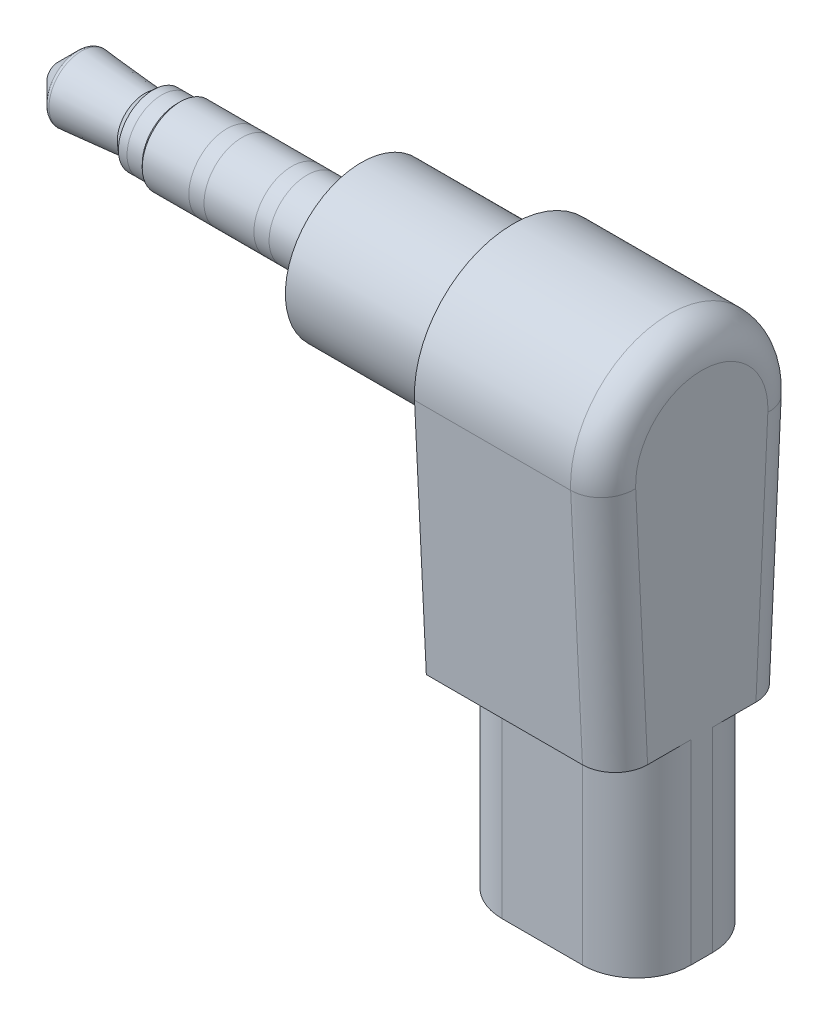
ISO-10303-21;
HEADER;
FILE_DESCRIPTION(('STEP AP214'),'2;1');
FILE_NAME('part.step','',(''),(''),'','','');
FILE_SCHEMA(('AUTOMOTIVE_DESIGN { 1 0 10303 214 1 1 1 1 }'));
ENDSEC;
DATA;
#1=APPLICATION_CONTEXT('core data for automotive mechanical design processes');
#2=APPLICATION_PROTOCOL_DEFINITION('international standard','automotive_design',2000,#1);
#3=PRODUCT_CONTEXT('',#1,'mechanical');
#4=PRODUCT('Part','Part','',(#3));
#5=PRODUCT_RELATED_PRODUCT_CATEGORY('part','',(#4));
#6=PRODUCT_DEFINITION_FORMATION('','',#4);
#7=PRODUCT_DEFINITION_CONTEXT('part definition',#1,'design');
#8=PRODUCT_DEFINITION('design','',#6,#7);
#9=PRODUCT_DEFINITION_SHAPE('','',#8);
#10=(LENGTH_UNIT() NAMED_UNIT(*) SI_UNIT(.MILLI.,.METRE.));
#11=(NAMED_UNIT(*) PLANE_ANGLE_UNIT() SI_UNIT($,.RADIAN.));
#12=(NAMED_UNIT(*) SI_UNIT($,.STERADIAN.) SOLID_ANGLE_UNIT());
#13=UNCERTAINTY_MEASURE_WITH_UNIT(LENGTH_MEASURE(1.E-05),#10,'distance_accuracy_value','');
#14=(GEOMETRIC_REPRESENTATION_CONTEXT(3) GLOBAL_UNCERTAINTY_ASSIGNED_CONTEXT((#13)) GLOBAL_UNIT_ASSIGNED_CONTEXT((#10,
#11,#12)) REPRESENTATION_CONTEXT('',''));
#15=CARTESIAN_POINT('',(0.,0.,0.));
#16=DIRECTION('',(0.,0.,1.));
#17=DIRECTION('',(1.,0.,0.));
#18=AXIS2_PLACEMENT_3D('',#15,#16,#17);
#19=CARTESIAN_POINT('',(1.07583027953361,0.,0.));
#20=DIRECTION('',(1.,0.,0.));
#21=DIRECTION('',(0.,0.,-1.));
#22=AXIS2_PLACEMENT_3D('',#19,#20,#21);
#23=TOROIDAL_SURFACE('',#22,1.29298756705899,0.2);
#24=CARTESIAN_POINT('',(0.934408923296304,0.,0.));
#25=DIRECTION('',(1.,0.,0.));
#26=DIRECTION('',(0.,-1.,0.));
#27=AXIS2_PLACEMENT_3D('',#24,#25,#26);
#28=CIRCLE('',#27,1.4344089232963);
#29=CARTESIAN_POINT('',(0.934408923296304,1.4344089232963,0.));
#30=VERTEX_POINT('',#29);
#31=EDGE_CURVE('E275',#30,#30,#28,.T.);
#32=ORIENTED_EDGE('',*,*,#31,.T.);
#33=EDGE_LOOP('',(#32));
#34=FACE_BOUND('',#33,.T.);
#35=CARTESIAN_POINT('',(1.09243937550436,0.,0.));
#36=DIRECTION('',(-1.,0.,0.));
#37=DIRECTION('',(0.,-1.,0.));
#38=AXIS2_PLACEMENT_3D('',#35,#36,#37);
#39=CIRCLE('',#38,1.49229671870797);
#40=CARTESIAN_POINT('',(1.09243937550436,1.49229671870797,0.));
#41=VERTEX_POINT('',#40);
#42=EDGE_CURVE('E264',#41,#41,#39,.T.);
#43=ORIENTED_EDGE('',*,*,#42,.T.);
#44=EDGE_LOOP('',(#43));
#45=FACE_BOUND('',#44,.T.);
#46=ADVANCED_FACE('F55',(#34,#45),#23,.T.);
#47=CARTESIAN_POINT('',(0.5,0.,0.));
#48=DIRECTION('',(1.,0.,0.));
#49=DIRECTION('',(0.,1.,0.));
#50=AXIS2_PLACEMENT_3D('',#47,#48,#49);
#51=CONICAL_SURFACE('',#50,1.,0.7853981634);
#52=CARTESIAN_POINT('',(0.,0.,0.));
#53=DIRECTION('',(1.,0.,0.));
#54=DIRECTION('',(0.,0.,-1.));
#55=AXIS2_PLACEMENT_3D('',#52,#53,#54);
#56=CIRCLE('',#55,0.5);
#57=CARTESIAN_POINT('',(0.,0.5,0.));
#58=VERTEX_POINT('',#57);
#59=EDGE_CURVE('E261',#58,#58,#56,.T.);
#60=ORIENTED_EDGE('',*,*,#59,.T.);
#61=EDGE_LOOP('',(#60));
#62=FACE_BOUND('',#61,.T.);
#63=ORIENTED_EDGE('',*,*,#31,.F.);
#64=EDGE_LOOP('',(#63));
#65=FACE_BOUND('',#64,.T.);
#66=ADVANCED_FACE('F407',(#62,#65),#51,.T.);
#67=CARTESIAN_POINT('',(2.5,0.,0.));
#68=DIRECTION('',(-1.,0.,0.));
#69=DIRECTION('',(0.,1.,0.));
#70=AXIS2_PLACEMENT_3D('',#67,#68,#69);
#71=CONICAL_SURFACE('',#70,1.375,0.083141231888712);
#72=CARTESIAN_POINT('',(4.,0.,0.));
#73=DIRECTION('',(1.,0.,0.));
#74=DIRECTION('',(0.,0.,-1.));
#75=AXIS2_PLACEMENT_3D('',#72,#73,#74);
#76=CIRCLE('',#75,1.25);
#77=CARTESIAN_POINT('',(4.,1.25,0.));
#78=VERTEX_POINT('',#77);
#79=EDGE_CURVE('E260',#78,#78,#76,.T.);
#80=ORIENTED_EDGE('',*,*,#79,.F.);
#81=EDGE_LOOP('',(#80));
#82=FACE_BOUND('',#81,.T.);
#83=ORIENTED_EDGE('',*,*,#42,.F.);
#84=EDGE_LOOP('',(#83));
#85=FACE_BOUND('',#84,.T.);
#86=ADVANCED_FACE('F413',(#82,#85),#71,.T.);
#87=CARTESIAN_POINT('',(5.15,0.,0.));
#88=DIRECTION('',(1.,0.,0.));
#89=DIRECTION('',(0.,1.,0.));
#90=AXIS2_PLACEMENT_3D('',#87,#88,#89);
#91=CYLINDRICAL_SURFACE('',#90,1.6);
#92=CARTESIAN_POINT('',(4.4,0.,0.));
#93=DIRECTION('',(1.,0.,0.));
#94=DIRECTION('',(0.,0.,-1.));
#95=AXIS2_PLACEMENT_3D('',#92,#93,#94);
#96=CIRCLE('',#95,1.6);
#97=CARTESIAN_POINT('',(4.4,1.6,0.));
#98=VERTEX_POINT('',#97);
#99=EDGE_CURVE('E265',#98,#98,#96,.T.);
#100=ORIENTED_EDGE('',*,*,#99,.T.);
#101=EDGE_LOOP('',(#100));
#102=FACE_BOUND('',#101,.T.);
#103=CARTESIAN_POINT('',(4.8,0.,0.));
#104=DIRECTION('',(1.,0.,0.));
#105=DIRECTION('',(0.,1.,0.));
#106=AXIS2_PLACEMENT_3D('',#103,#104,#105);
#107=CIRCLE('',#106,1.6);
#108=CARTESIAN_POINT('',(4.8,-1.6,0.));
#109=VERTEX_POINT('',#108);
#110=EDGE_CURVE('E274',#109,#109,#107,.T.);
#111=ORIENTED_EDGE('',*,*,#110,.F.);
#112=EDGE_LOOP('',(#111));
#113=FACE_BOUND('',#112,.T.);
#114=ADVANCED_FACE('F425',(#102,#113),#91,.T.);
#115=CARTESIAN_POINT('',(12.75,0.,0.));
#116=DIRECTION('',(1.,0.,0.));
#117=DIRECTION('',(0.,1.,0.));
#118=AXIS2_PLACEMENT_3D('',#115,#116,#117);
#119=CYLINDRICAL_SURFACE('',#118,1.75);
#120=CARTESIAN_POINT('',(8.5,0.,0.));
#121=DIRECTION('',(-1.,0.,0.));
#122=DIRECTION('',(0.,1.,0.));
#123=AXIS2_PLACEMENT_3D('',#120,#121,#122);
#124=CIRCLE('',#123,1.75);
#125=CARTESIAN_POINT('',(8.5,-1.75,0.));
#126=VERTEX_POINT('',#125);
#127=EDGE_CURVE('E270',#126,#126,#124,.T.);
#128=ORIENTED_EDGE('',*,*,#127,.T.);
#129=EDGE_LOOP('',(#128));
#130=FACE_BOUND('',#129,.T.);
#131=CARTESIAN_POINT('',(7.8,0.,0.));
#132=DIRECTION('',(-1.,0.,0.));
#133=DIRECTION('',(0.,1.,0.));
#134=AXIS2_PLACEMENT_3D('',#131,#132,#133);
#135=CIRCLE('',#134,1.75);
#136=CARTESIAN_POINT('',(7.8,-1.75,0.));
#137=VERTEX_POINT('',#136);
#138=EDGE_CURVE('E252',#137,#137,#135,.T.);
#139=ORIENTED_EDGE('',*,*,#138,.F.);
#140=EDGE_LOOP('',(#139));
#141=FACE_BOUND('',#140,.T.);
#142=ADVANCED_FACE('F421',(#130,#141),#119,.T.);
#143=CARTESIAN_POINT('',(12.75,0.,0.));
#144=DIRECTION('',(1.,0.,0.));
#145=DIRECTION('',(0.,1.,0.));
#146=AXIS2_PLACEMENT_3D('',#143,#144,#145);
#147=CYLINDRICAL_SURFACE('',#146,1.75);
#148=CARTESIAN_POINT('',(10.8,0.,0.));
#149=DIRECTION('',(-1.,0.,0.));
#150=DIRECTION('',(0.,1.,0.));
#151=AXIS2_PLACEMENT_3D('',#148,#149,#150);
#152=CIRCLE('',#151,1.75);
#153=CARTESIAN_POINT('',(10.8,-1.75,0.));
#154=VERTEX_POINT('',#153);
#155=EDGE_CURVE('E255',#154,#154,#152,.T.);
#156=ORIENTED_EDGE('',*,*,#155,.T.);
#157=EDGE_LOOP('',(#156));
#158=FACE_BOUND('',#157,.T.);
#159=ORIENTED_EDGE('',*,*,#127,.F.);
#160=EDGE_LOOP('',(#159));
#161=FACE_BOUND('',#160,.T.);
#162=ADVANCED_FACE('F424',(#158,#161),#147,.T.);
#163=CARTESIAN_POINT('',(12.75,0.,0.));
#164=DIRECTION('',(1.,0.,0.));
#165=DIRECTION('',(0.,1.,0.));
#166=AXIS2_PLACEMENT_3D('',#163,#164,#165);
#167=CYLINDRICAL_SURFACE('',#166,1.75);
#168=CARTESIAN_POINT('',(11.5,0.,0.));
#169=DIRECTION('',(1.,0.,0.));
#170=DIRECTION('',(0.,1.,0.));
#171=AXIS2_PLACEMENT_3D('',#168,#169,#170);
#172=CIRCLE('',#171,1.75);
#173=CARTESIAN_POINT('',(11.5,-1.75,0.));
#174=VERTEX_POINT('',#173);
#175=EDGE_CURVE('E249',#174,#174,#172,.T.);
#176=ORIENTED_EDGE('',*,*,#175,.F.);
#177=EDGE_LOOP('',(#176));
#178=FACE_BOUND('',#177,.T.);
#179=ORIENTED_EDGE('',*,*,#155,.F.);
#180=EDGE_LOOP('',(#179));
#181=FACE_BOUND('',#180,.T.);
#182=ADVANCED_FACE('F438',(#178,#181),#167,.T.);
#183=CARTESIAN_POINT('',(12.75,0.,0.));
#184=DIRECTION('',(1.,0.,0.));
#185=DIRECTION('',(0.,1.,0.));
#186=AXIS2_PLACEMENT_3D('',#183,#184,#185);
#187=CYLINDRICAL_SURFACE('',#186,1.75);
#188=ORIENTED_EDGE('',*,*,#138,.T.);
#189=EDGE_LOOP('',(#188));
#190=FACE_BOUND('',#189,.T.);
#191=CARTESIAN_POINT('',(5.65,0.,0.));
#192=DIRECTION('',(1.,0.,0.));
#193=DIRECTION('',(0.,0.,-1.));
#194=AXIS2_PLACEMENT_3D('',#191,#192,#193);
#195=CIRCLE('',#194,1.75);
#196=CARTESIAN_POINT('',(5.65,1.75,0.));
#197=VERTEX_POINT('',#196);
#198=EDGE_CURVE('E256',#197,#197,#195,.T.);
#199=ORIENTED_EDGE('',*,*,#198,.T.);
#200=EDGE_LOOP('',(#199));
#201=FACE_BOUND('',#200,.T.);
#202=ADVANCED_FACE('F434',(#190,#201),#187,.T.);
#203=CARTESIAN_POINT('',(0.,0.5,0.));
#204=DIRECTION('',(-1.,0.,0.));
#205=DIRECTION('',(0.,0.,1.));
#206=AXIS2_PLACEMENT_3D('',#203,#204,#205);
#207=PLANE('',#206);
#208=ORIENTED_EDGE('',*,*,#59,.F.);
#209=EDGE_LOOP('',(#208));
#210=FACE_BOUND('',#209,.T.);
#211=ADVANCED_FACE('F430',(#210),#207,.T.);
#212=CARTESIAN_POINT('',(4.2,0.,0.));
#213=DIRECTION('',(1.,0.,0.));
#214=DIRECTION('',(0.,1.,0.));
#215=AXIS2_PLACEMENT_3D('',#212,#213,#214);
#216=CONICAL_SURFACE('',#215,1.425,0.718829999623961);
#217=ORIENTED_EDGE('',*,*,#79,.T.);
#218=EDGE_LOOP('',(#217));
#219=FACE_BOUND('',#218,.T.);
#220=ORIENTED_EDGE('',*,*,#99,.F.);
#221=EDGE_LOOP('',(#220));
#222=FACE_BOUND('',#221,.T.);
#223=ADVANCED_FACE('F433',(#219,#222),#216,.T.);
#224=CARTESIAN_POINT('',(5.15,0.,0.));
#225=DIRECTION('',(1.,0.,0.));
#226=DIRECTION('',(0.,1.,0.));
#227=AXIS2_PLACEMENT_3D('',#224,#225,#226);
#228=CYLINDRICAL_SURFACE('',#227,1.6);
#229=ORIENTED_EDGE('',*,*,#110,.T.);
#230=EDGE_LOOP('',(#229));
#231=FACE_BOUND('',#230,.T.);
#232=CARTESIAN_POINT('',(5.5,0.,0.));
#233=DIRECTION('',(1.,0.,0.));
#234=DIRECTION('',(0.,0.,-1.));
#235=AXIS2_PLACEMENT_3D('',#232,#233,#234);
#236=CIRCLE('',#235,1.6);
#237=CARTESIAN_POINT('',(5.5,1.6,0.));
#238=VERTEX_POINT('',#237);
#239=EDGE_CURVE('E271',#238,#238,#236,.T.);
#240=ORIENTED_EDGE('',*,*,#239,.F.);
#241=EDGE_LOOP('',(#240));
#242=FACE_BOUND('',#241,.T.);
#243=ADVANCED_FACE('F555',(#231,#242),#228,.T.);
#244=CARTESIAN_POINT('',(5.575,0.,0.));
#245=DIRECTION('',(1.,0.,0.));
#246=DIRECTION('',(0.,1.,0.));
#247=AXIS2_PLACEMENT_3D('',#244,#245,#246);
#248=CONICAL_SURFACE('',#247,1.675,0.7853981634);
#249=ORIENTED_EDGE('',*,*,#239,.T.);
#250=EDGE_LOOP('',(#249));
#251=FACE_BOUND('',#250,.T.);
#252=ORIENTED_EDGE('',*,*,#198,.F.);
#253=EDGE_LOOP('',(#252));
#254=FACE_BOUND('',#253,.T.);
#255=ADVANCED_FACE('F547',(#251,#254),#248,.T.);
#256=CARTESIAN_POINT('',(12.75,0.,0.));
#257=DIRECTION('',(1.,0.,0.));
#258=DIRECTION('',(0.,1.,0.));
#259=AXIS2_PLACEMENT_3D('',#256,#257,#258);
#260=CYLINDRICAL_SURFACE('',#259,1.75);
#261=ORIENTED_EDGE('',*,*,#175,.T.);
#262=EDGE_LOOP('',(#261));
#263=FACE_BOUND('',#262,.T.);
#264=CARTESIAN_POINT('',(14.,0.,0.));
#265=DIRECTION('',(1.,0.,0.));
#266=DIRECTION('',(0.,0.,-1.));
#267=AXIS2_PLACEMENT_3D('',#264,#265,#266);
#268=CIRCLE('',#267,1.75);
#269=CARTESIAN_POINT('',(14.,0.,-1.75));
#270=VERTEX_POINT('',#269);
#271=EDGE_CURVE('E257',#270,#270,#268,.T.);
#272=ORIENTED_EDGE('',*,*,#271,.F.);
#273=EDGE_LOOP('',(#272));
#274=FACE_BOUND('',#273,.T.);
#275=ADVANCED_FACE('F418',(#263,#274),#260,.T.);
#276=CARTESIAN_POINT('',(21.,0.,0.));
#277=DIRECTION('',(-1.,0.,0.));
#278=DIRECTION('',(0.,0.,1.));
#279=AXIS2_PLACEMENT_3D('',#276,#277,#278);
#280=CYLINDRICAL_SURFACE('',#279,3.5);
#281=CARTESIAN_POINT('',(21.,0.,0.));
#282=DIRECTION('',(1.,0.,0.));
#283=DIRECTION('',(0.,0.,-1.));
#284=AXIS2_PLACEMENT_3D('',#281,#282,#283);
#285=CIRCLE('',#284,3.5);
#286=CARTESIAN_POINT('',(21.,0.,-3.5));
#287=VERTEX_POINT('',#286);
#288=EDGE_CURVE('E246',#287,#287,#285,.T.);
#289=ORIENTED_EDGE('',*,*,#288,.F.);
#290=EDGE_LOOP('',(#289));
#291=FACE_BOUND('',#290,.T.);
#292=CARTESIAN_POINT('',(14.,0.,0.));
#293=DIRECTION('',(1.,0.,0.));
#294=DIRECTION('',(0.,0.,-1.));
#295=AXIS2_PLACEMENT_3D('',#292,#293,#294);
#296=CIRCLE('',#295,3.5);
#297=CARTESIAN_POINT('',(14.,0.,-3.5));
#298=VERTEX_POINT('',#297);
#299=EDGE_CURVE('E198',#298,#298,#296,.T.);
#300=ORIENTED_EDGE('',*,*,#299,.T.);
#301=EDGE_LOOP('',(#300));
#302=FACE_BOUND('',#301,.T.);
#303=ADVANCED_FACE('F531',(#291,#302),#280,.T.);
#304=CARTESIAN_POINT('',(14.,0.,0.));
#305=DIRECTION('',(1.,0.,0.));
#306=DIRECTION('',(0.,0.,-1.));
#307=AXIS2_PLACEMENT_3D('',#304,#305,#306);
#308=PLANE('',#307);
#309=ORIENTED_EDGE('',*,*,#271,.T.);
#310=EDGE_LOOP('',(#309));
#311=FACE_BOUND('',#310,.T.);
#312=ORIENTED_EDGE('',*,*,#299,.F.);
#313=EDGE_LOOP('',(#312));
#314=FACE_BOUND('',#313,.T.);
#315=ADVANCED_FACE('F521',(#311,#314),#308,.F.);
#316=CARTESIAN_POINT('',(29.7,0.,0.));
#317=DIRECTION('',(-1.,0.,0.));
#318=DIRECTION('',(0.,0.,1.));
#319=AXIS2_PLACEMENT_3D('',#316,#317,#318);
#320=CYLINDRICAL_SURFACE('',#319,4.55);
#321=DIRECTION('',(-1.,0.,0.));
#322=VECTOR('',#321,1.);
#323=CARTESIAN_POINT('',(29.7,-0.220425293000434,4.54465759878626));
#324=LINE('',#323,#322);
#325=CARTESIAN_POINT('',(28.2,-0.220425293000434,4.54465759878626));
#326=VERTEX_POINT('',#325);
#327=CARTESIAN_POINT('',(21.,-0.220425293000434,4.54465759878626));
#328=VERTEX_POINT('',#327);
#329=EDGE_CURVE('E190',#326,#328,#324,.T.);
#330=ORIENTED_EDGE('',*,*,#329,.F.);
#331=CARTESIAN_POINT('',(28.2,0.,0.));
#332=DIRECTION('',(1.,0.,0.));
#333=DIRECTION('',(0.,0.,-1.));
#334=AXIS2_PLACEMENT_3D('',#331,#332,#333);
#335=CIRCLE('',#334,4.55);
#336=CARTESIAN_POINT('',(28.2,-0.220425293000434,-4.54465759878626));
#337=VERTEX_POINT('',#336);
#338=EDGE_CURVE('E339',#326,#337,#335,.F.);
#339=ORIENTED_EDGE('',*,*,#338,.T.);
#340=DIRECTION('',(-1.,0.,0.));
#341=VECTOR('',#340,1.);
#342=CARTESIAN_POINT('',(29.7,-0.220425293000434,-4.54465759878626));
#343=LINE('',#342,#341);
#344=CARTESIAN_POINT('',(21.,-0.220425293000434,-4.54465759878626));
#345=VERTEX_POINT('',#344);
#346=EDGE_CURVE('E211',#337,#345,#343,.T.);
#347=ORIENTED_EDGE('',*,*,#346,.T.);
#348=CARTESIAN_POINT('',(21.,0.,0.));
#349=DIRECTION('',(1.,0.,0.));
#350=DIRECTION('',(0.,0.,-1.));
#351=AXIS2_PLACEMENT_3D('',#348,#349,#350);
#352=CIRCLE('',#351,4.55);
#353=EDGE_CURVE('E205',#345,#328,#352,.T.);
#354=ORIENTED_EDGE('',*,*,#353,.T.);
#355=EDGE_LOOP('',(#330,#339,#347,#354));
#356=FACE_BOUND('',#355,.T.);
#357=ADVANCED_FACE('F209',(#356),#320,.T.);
#358=CARTESIAN_POINT('',(29.7,-11.45,4.));
#359=DIRECTION('',(0.,0.0484451193407548,-0.99882584588709));
#360=DIRECTION('',(0.,0.99882584588709,0.0484451193407548));
#361=AXIS2_PLACEMENT_3D('',#358,#359,#360);
#362=PLANE('',#361);
#363=DIRECTION('',(-1.,0.,0.));
#364=VECTOR('',#363,1.);
#365=CARTESIAN_POINT('',(29.7,-11.45,4.));
#366=LINE('',#365,#364);
#367=CARTESIAN_POINT('',(28.2,-11.45,4.));
#368=VERTEX_POINT('',#367);
#369=CARTESIAN_POINT('',(21.,-11.45,4.));
#370=VERTEX_POINT('',#369);
#371=EDGE_CURVE('E199',#368,#370,#366,.T.);
#372=ORIENTED_EDGE('',*,*,#371,.F.);
#373=DIRECTION('',(0.,-0.99882584588709,-0.0484451193407548));
#374=VECTOR('',#373,1.);
#375=CARTESIAN_POINT('',(28.2,-0.220425293000434,4.54465759878626));
#376=LINE('',#375,#374);
#377=EDGE_CURVE('E14',#368,#326,#376,.F.);
#378=ORIENTED_EDGE('',*,*,#377,.T.);
#379=ORIENTED_EDGE('',*,*,#329,.T.);
#380=DIRECTION('',(0.,-0.99882584588709,-0.0484451193407548));
#381=VECTOR('',#380,1.);
#382=CARTESIAN_POINT('',(21.,-11.45,4.));
#383=LINE('',#382,#381);
#384=EDGE_CURVE('E193',#328,#370,#383,.T.);
#385=ORIENTED_EDGE('',*,*,#384,.T.);
#386=EDGE_LOOP('',(#372,#378,#379,#385));
#387=FACE_BOUND('',#386,.T.);
#388=ADVANCED_FACE('F192',(#387),#362,.F.);
#389=CARTESIAN_POINT('',(29.7,-11.45,4.));
#390=DIRECTION('',(0.,1.,0.));
#391=DIRECTION('',(0.,0.,1.));
#392=AXIS2_PLACEMENT_3D('',#389,#390,#391);
#393=PLANE('',#392);
#394=DIRECTION('',(0.,0.,-1.));
#395=VECTOR('',#394,1.);
#396=CARTESIAN_POINT('',(29.7,-11.45,4.));
#397=LINE('',#396,#395);
#398=CARTESIAN_POINT('',(29.7,-11.45,2.49823669844286));
#399=VERTEX_POINT('',#398);
#400=CARTESIAN_POINT('',(29.7,-11.45,0.500000000000001));
#401=VERTEX_POINT('',#400);
#402=EDGE_CURVE('E229',#399,#401,#397,.T.);
#403=ORIENTED_EDGE('',*,*,#402,.F.);
#404=CARTESIAN_POINT('',(28.2,-11.45,2.49823669844286));
#405=DIRECTION('',(0.,1.,0.));
#406=DIRECTION('',(0.,0.,1.));
#407=AXIS2_PLACEMENT_3D('',#404,#405,#406);
#408=ELLIPSE('',#407,1.50176330155714,1.5);
#409=EDGE_CURVE('E64',#399,#368,#408,.F.);
#410=ORIENTED_EDGE('',*,*,#409,.T.);
#411=ORIENTED_EDGE('',*,*,#371,.T.);
#412=DIRECTION('',(0.,0.,-1.));
#413=VECTOR('',#412,1.);
#414=CARTESIAN_POINT('',(21.,-11.45,4.));
#415=LINE('',#414,#413);
#416=CARTESIAN_POINT('',(21.,-11.45,0.500000000000001));
#417=VERTEX_POINT('',#416);
#418=EDGE_CURVE('E207',#370,#417,#415,.T.);
#419=ORIENTED_EDGE('',*,*,#418,.T.);
#420=CARTESIAN_POINT('',(23.5,-11.45,0.500000000000001));
#421=DIRECTION('',(0.,1.,0.));
#422=DIRECTION('',(0.,0.,1.));
#423=AXIS2_PLACEMENT_3D('',#420,#421,#422);
#424=CIRCLE('',#423,2.5);
#425=CARTESIAN_POINT('',(23.5,-11.45,3.));
#426=VERTEX_POINT('',#425);
#427=EDGE_CURVE('E321',#417,#426,#424,.T.);
#428=ORIENTED_EDGE('',*,*,#427,.T.);
#429=DIRECTION('',(-1.,0.,0.));
#430=VECTOR('',#429,1.);
#431=CARTESIAN_POINT('',(29.7,-11.45,3.));
#432=LINE('',#431,#430);
#433=CARTESIAN_POINT('',(27.2,-11.45,3.));
#434=VERTEX_POINT('',#433);
#435=EDGE_CURVE('E242',#434,#426,#432,.T.);
#436=ORIENTED_EDGE('',*,*,#435,.F.);
#437=CARTESIAN_POINT('',(27.2,-11.45,0.500000000000001));
#438=DIRECTION('',(0.,1.,0.));
#439=DIRECTION('',(0.,0.,1.));
#440=AXIS2_PLACEMENT_3D('',#437,#438,#439);
#441=CIRCLE('',#440,2.5);
#442=EDGE_CURVE('E325',#434,#401,#441,.T.);
#443=ORIENTED_EDGE('',*,*,#442,.T.);
#444=EDGE_LOOP('',(#403,#410,#411,#419,#428,#436,#443));
#445=FACE_BOUND('',#444,.T.);
#446=ADVANCED_FACE('F365',(#445),#393,.F.);
#447=CARTESIAN_POINT('',(29.7,-11.45,3.));
#448=DIRECTION('',(0.,0.,-1.));
#449=DIRECTION('',(0.,1.,0.));
#450=AXIS2_PLACEMENT_3D('',#447,#448,#449);
#451=PLANE('',#450);
#452=ORIENTED_EDGE('',*,*,#435,.T.);
#453=DIRECTION('',(0.,-1.,0.));
#454=VECTOR('',#453,1.);
#455=CARTESIAN_POINT('',(23.5,-11.45,3.));
#456=LINE('',#455,#454);
#457=CARTESIAN_POINT('',(23.5,-20.45,3.));
#458=VERTEX_POINT('',#457);
#459=EDGE_CURVE('E309',#426,#458,#456,.T.);
#460=ORIENTED_EDGE('',*,*,#459,.T.);
#461=DIRECTION('',(-1.,0.,0.));
#462=VECTOR('',#461,1.);
#463=CARTESIAN_POINT('',(29.7,-20.45,3.));
#464=LINE('',#463,#462);
#465=CARTESIAN_POINT('',(27.2,-20.45,3.));
#466=VERTEX_POINT('',#465);
#467=EDGE_CURVE('E239',#466,#458,#464,.T.);
#468=ORIENTED_EDGE('',*,*,#467,.F.);
#469=DIRECTION('',(0.,-1.,0.));
#470=VECTOR('',#469,1.);
#471=CARTESIAN_POINT('',(27.2,-11.45,3.));
#472=LINE('',#471,#470);
#473=EDGE_CURVE('E307',#466,#434,#472,.F.);
#474=ORIENTED_EDGE('',*,*,#473,.T.);
#475=EDGE_LOOP('',(#452,#460,#468,#474));
#476=FACE_BOUND('',#475,.T.);
#477=ADVANCED_FACE('F373',(#476),#451,.F.);
#478=CARTESIAN_POINT('',(29.7,-20.45,3.));
#479=DIRECTION('',(0.,1.,0.));
#480=DIRECTION('',(0.,0.,1.));
#481=AXIS2_PLACEMENT_3D('',#478,#479,#480);
#482=PLANE('',#481);
#483=DIRECTION('',(0.,0.,-1.));
#484=VECTOR('',#483,1.);
#485=CARTESIAN_POINT('',(21.,-20.45,3.));
#486=LINE('',#485,#484);
#487=CARTESIAN_POINT('',(21.,-20.45,0.5));
#488=VERTEX_POINT('',#487);
#489=CARTESIAN_POINT('',(21.,-20.45,-0.5));
#490=VERTEX_POINT('',#489);
#491=EDGE_CURVE('E221',#488,#490,#486,.T.);
#492=ORIENTED_EDGE('',*,*,#491,.T.);
#493=CARTESIAN_POINT('',(23.5,-20.45,-0.5));
#494=DIRECTION('',(0.,1.,0.));
#495=DIRECTION('',(0.,0.,1.));
#496=AXIS2_PLACEMENT_3D('',#493,#494,#495);
#497=CIRCLE('',#496,2.5);
#498=CARTESIAN_POINT('',(23.5,-20.45,-3.));
#499=VERTEX_POINT('',#498);
#500=EDGE_CURVE('E305',#490,#499,#497,.F.);
#501=ORIENTED_EDGE('',*,*,#500,.T.);
#502=DIRECTION('',(-1.,0.,0.));
#503=VECTOR('',#502,1.);
#504=CARTESIAN_POINT('',(29.7,-20.45,-3.));
#505=LINE('',#504,#503);
#506=CARTESIAN_POINT('',(27.2,-20.45,-3.));
#507=VERTEX_POINT('',#506);
#508=EDGE_CURVE('E236',#507,#499,#505,.T.);
#509=ORIENTED_EDGE('',*,*,#508,.F.);
#510=CARTESIAN_POINT('',(27.2,-20.45,-0.5));
#511=DIRECTION('',(0.,1.,0.));
#512=DIRECTION('',(0.,0.,1.));
#513=AXIS2_PLACEMENT_3D('',#510,#511,#512);
#514=CIRCLE('',#513,2.5);
#515=CARTESIAN_POINT('',(29.7,-20.45,-0.5));
#516=VERTEX_POINT('',#515);
#517=EDGE_CURVE('E301',#507,#516,#514,.F.);
#518=ORIENTED_EDGE('',*,*,#517,.T.);
#519=DIRECTION('',(0.,0.,-1.));
#520=VECTOR('',#519,1.);
#521=CARTESIAN_POINT('',(29.7,-20.45,3.));
#522=LINE('',#521,#520);
#523=CARTESIAN_POINT('',(29.7,-20.45,0.5));
#524=VERTEX_POINT('',#523);
#525=EDGE_CURVE('E359',#524,#516,#522,.T.);
#526=ORIENTED_EDGE('',*,*,#525,.F.);
#527=CARTESIAN_POINT('',(27.2,-20.45,0.5));
#528=DIRECTION('',(0.,1.,0.));
#529=DIRECTION('',(0.,0.,1.));
#530=AXIS2_PLACEMENT_3D('',#527,#528,#529);
#531=CIRCLE('',#530,2.5);
#532=EDGE_CURVE('E299',#524,#466,#531,.F.);
#533=ORIENTED_EDGE('',*,*,#532,.T.);
#534=ORIENTED_EDGE('',*,*,#467,.T.);
#535=CARTESIAN_POINT('',(23.5,-20.45,0.5));
#536=DIRECTION('',(0.,1.,0.));
#537=DIRECTION('',(0.,0.,1.));
#538=AXIS2_PLACEMENT_3D('',#535,#536,#537);
#539=CIRCLE('',#538,2.5);
#540=EDGE_CURVE('E303',#458,#488,#539,.F.);
#541=ORIENTED_EDGE('',*,*,#540,.T.);
#542=EDGE_LOOP('',(#492,#501,#509,#518,#526,#533,#534,#541));
#543=FACE_BOUND('',#542,.T.);
#544=ADVANCED_FACE('F371',(#543),#482,.F.);
#545=CARTESIAN_POINT('',(29.7,-11.45,-3.));
#546=DIRECTION('',(0.,0.,1.));
#547=DIRECTION('',(0.,-1.,0.));
#548=AXIS2_PLACEMENT_3D('',#545,#546,#547);
#549=PLANE('',#548);
#550=ORIENTED_EDGE('',*,*,#508,.T.);
#551=DIRECTION('',(0.,1.,0.));
#552=VECTOR('',#551,1.);
#553=CARTESIAN_POINT('',(23.5,-11.45,-3.));
#554=LINE('',#553,#552);
#555=CARTESIAN_POINT('',(23.5,-11.45,-3.));
#556=VERTEX_POINT('',#555);
#557=EDGE_CURVE('E292',#499,#556,#554,.T.);
#558=ORIENTED_EDGE('',*,*,#557,.T.);
#559=DIRECTION('',(-1.,0.,0.));
#560=VECTOR('',#559,1.);
#561=CARTESIAN_POINT('',(29.7,-11.45,-3.));
#562=LINE('',#561,#560);
#563=CARTESIAN_POINT('',(27.2,-11.45,-3.));
#564=VERTEX_POINT('',#563);
#565=EDGE_CURVE('E233',#564,#556,#562,.T.);
#566=ORIENTED_EDGE('',*,*,#565,.F.);
#567=DIRECTION('',(0.,1.,0.));
#568=VECTOR('',#567,1.);
#569=CARTESIAN_POINT('',(27.2,-20.45,-3.));
#570=LINE('',#569,#568);
#571=EDGE_CURVE('E278',#564,#507,#570,.F.);
#572=ORIENTED_EDGE('',*,*,#571,.T.);
#573=EDGE_LOOP('',(#550,#558,#566,#572));
#574=FACE_BOUND('',#573,.T.);
#575=ADVANCED_FACE('F388',(#574),#549,.F.);
#576=CARTESIAN_POINT('',(29.7,-11.45,-4.));
#577=DIRECTION('',(0.,1.,0.));
#578=DIRECTION('',(0.,0.,1.));
#579=AXIS2_PLACEMENT_3D('',#576,#577,#578);
#580=PLANE('',#579);
#581=DIRECTION('',(-1.,0.,0.));
#582=VECTOR('',#581,1.);
#583=CARTESIAN_POINT('',(29.7,-11.45,-4.));
#584=LINE('',#583,#582);
#585=CARTESIAN_POINT('',(28.2,-11.45,-4.));
#586=VERTEX_POINT('',#585);
#587=CARTESIAN_POINT('',(21.,-11.45,-4.));
#588=VERTEX_POINT('',#587);
#589=EDGE_CURVE('E231',#586,#588,#584,.T.);
#590=ORIENTED_EDGE('',*,*,#589,.F.);
#591=CARTESIAN_POINT('',(28.2,-11.45,-2.49823669844286));
#592=DIRECTION('',(0.,1.,0.));
#593=DIRECTION('',(0.,0.,1.));
#594=AXIS2_PLACEMENT_3D('',#591,#592,#593);
#595=ELLIPSE('',#594,1.50176330155714,1.5);
#596=CARTESIAN_POINT('',(29.7,-11.45,-2.49823669844286));
#597=VERTEX_POINT('',#596);
#598=EDGE_CURVE('E337',#586,#597,#595,.F.);
#599=ORIENTED_EDGE('',*,*,#598,.T.);
#600=DIRECTION('',(0.,0.,-1.));
#601=VECTOR('',#600,1.);
#602=CARTESIAN_POINT('',(29.7,-11.45,-4.));
#603=LINE('',#602,#601);
#604=CARTESIAN_POINT('',(29.7,-11.45,-0.499999999999996));
#605=VERTEX_POINT('',#604);
#606=EDGE_CURVE('E217',#605,#597,#603,.T.);
#607=ORIENTED_EDGE('',*,*,#606,.F.);
#608=CARTESIAN_POINT('',(27.2,-11.45,-0.499999999999996));
#609=DIRECTION('',(0.,1.,0.));
#610=DIRECTION('',(0.,0.,1.));
#611=AXIS2_PLACEMENT_3D('',#608,#609,#610);
#612=CIRCLE('',#611,2.5);
#613=EDGE_CURVE('E323',#605,#564,#612,.T.);
#614=ORIENTED_EDGE('',*,*,#613,.T.);
#615=ORIENTED_EDGE('',*,*,#565,.T.);
#616=CARTESIAN_POINT('',(23.5,-11.45,-0.499999999999996));
#617=DIRECTION('',(0.,1.,0.));
#618=DIRECTION('',(0.,0.,1.));
#619=AXIS2_PLACEMENT_3D('',#616,#617,#618);
#620=CIRCLE('',#619,2.5);
#621=CARTESIAN_POINT('',(21.,-11.45,-0.499999999999996));
#622=VERTEX_POINT('',#621);
#623=EDGE_CURVE('E318',#556,#622,#620,.T.);
#624=ORIENTED_EDGE('',*,*,#623,.T.);
#625=DIRECTION('',(0.,0.,-1.));
#626=VECTOR('',#625,1.);
#627=CARTESIAN_POINT('',(21.,-11.45,-4.));
#628=LINE('',#627,#626);
#629=EDGE_CURVE('E224',#622,#588,#628,.T.);
#630=ORIENTED_EDGE('',*,*,#629,.T.);
#631=EDGE_LOOP('',(#590,#599,#607,#614,#615,#624,#630));
#632=FACE_BOUND('',#631,.T.);
#633=ADVANCED_FACE('F394',(#632),#580,.F.);
#634=CARTESIAN_POINT('',(29.7,-11.45,-4.));
#635=DIRECTION('',(0.,0.0484451193407548,0.99882584588709));
#636=DIRECTION('',(0.,-0.99882584588709,0.0484451193407548));
#637=AXIS2_PLACEMENT_3D('',#634,#635,#636);
#638=PLANE('',#637);
#639=ORIENTED_EDGE('',*,*,#346,.F.);
#640=DIRECTION('',(0.,0.99882584588709,-0.0484451193407548));
#641=VECTOR('',#640,1.);
#642=CARTESIAN_POINT('',(28.2,-11.45,-4.));
#643=LINE('',#642,#641);
#644=EDGE_CURVE('E335',#337,#586,#643,.F.);
#645=ORIENTED_EDGE('',*,*,#644,.T.);
#646=ORIENTED_EDGE('',*,*,#589,.T.);
#647=DIRECTION('',(0.,0.99882584588709,-0.0484451193407548));
#648=VECTOR('',#647,1.);
#649=CARTESIAN_POINT('',(21.,-11.45,-4.));
#650=LINE('',#649,#648);
#651=EDGE_CURVE('E227',#588,#345,#650,.T.);
#652=ORIENTED_EDGE('',*,*,#651,.T.);
#653=EDGE_LOOP('',(#639,#645,#646,#652));
#654=FACE_BOUND('',#653,.T.);
#655=ADVANCED_FACE('F396',(#654),#638,.F.);
#656=CARTESIAN_POINT('',(29.7,0.,0.));
#657=DIRECTION('',(1.,0.,0.));
#658=DIRECTION('',(0.,0.,-1.));
#659=AXIS2_PLACEMENT_3D('',#656,#657,#658);
#660=PLANE('',#659);
#661=ORIENTED_EDGE('',*,*,#606,.T.);
#662=DIRECTION('',(0.,0.99882584588709,-0.0484451193407548));
#663=VECTOR('',#662,1.);
#664=CARTESIAN_POINT('',(29.7,-0.147757613989302,-3.04641882995562));
#665=LINE('',#664,#663);
#666=CARTESIAN_POINT('',(29.7,-0.147757613989302,-3.04641882995562));
#667=VERTEX_POINT('',#666);
#668=EDGE_CURVE('E332',#597,#667,#665,.T.);
#669=ORIENTED_EDGE('',*,*,#668,.T.);
#670=CARTESIAN_POINT('',(29.7,0.,0.));
#671=DIRECTION('',(1.,0.,0.));
#672=DIRECTION('',(0.,0.,-1.));
#673=AXIS2_PLACEMENT_3D('',#670,#671,#672);
#674=CIRCLE('',#673,3.05);
#675=CARTESIAN_POINT('',(29.7,-0.147757613989302,3.04641882995562));
#676=VERTEX_POINT('',#675);
#677=EDGE_CURVE('E330',#667,#676,#674,.T.);
#678=ORIENTED_EDGE('',*,*,#677,.T.);
#679=DIRECTION('',(0.,-0.99882584588709,-0.0484451193407548));
#680=VECTOR('',#679,1.);
#681=CARTESIAN_POINT('',(29.7,-11.3773323209889,2.50176123116937));
#682=LINE('',#681,#680);
#683=EDGE_CURVE('E328',#676,#399,#682,.T.);
#684=ORIENTED_EDGE('',*,*,#683,.T.);
#685=ORIENTED_EDGE('',*,*,#402,.T.);
#686=DIRECTION('',(0.,-1.,0.));
#687=VECTOR('',#686,1.);
#688=CARTESIAN_POINT('',(29.7,-20.45,0.5));
#689=LINE('',#688,#687);
#690=EDGE_CURVE('E312',#401,#524,#689,.T.);
#691=ORIENTED_EDGE('',*,*,#690,.T.);
#692=ORIENTED_EDGE('',*,*,#525,.T.);
#693=DIRECTION('',(0.,1.,0.));
#694=VECTOR('',#693,1.);
#695=CARTESIAN_POINT('',(29.7,-11.45,-0.499999999999996));
#696=LINE('',#695,#694);
#697=EDGE_CURVE('E315',#516,#605,#696,.T.);
#698=ORIENTED_EDGE('',*,*,#697,.T.);
#699=EDGE_LOOP('',(#661,#669,#678,#684,#685,#691,#692,#698));
#700=FACE_BOUND('',#699,.T.);
#701=ADVANCED_FACE('F354',(#700),#660,.T.);
#702=CARTESIAN_POINT('',(21.,0.,0.));
#703=DIRECTION('',(1.,0.,0.));
#704=DIRECTION('',(0.,0.,-1.));
#705=AXIS2_PLACEMENT_3D('',#702,#703,#704);
#706=PLANE('',#705);
#707=ORIENTED_EDGE('',*,*,#288,.T.);
#708=EDGE_LOOP('',(#707));
#709=FACE_BOUND('',#708,.T.);
#710=ORIENTED_EDGE('',*,*,#629,.F.);
#711=DIRECTION('',(0.,1.,0.));
#712=VECTOR('',#711,1.);
#713=CARTESIAN_POINT('',(21.,0.,-0.49999999999999));
#714=LINE('',#713,#712);
#715=EDGE_CURVE('E297',#622,#490,#714,.F.);
#716=ORIENTED_EDGE('',*,*,#715,.T.);
#717=ORIENTED_EDGE('',*,*,#491,.F.);
#718=DIRECTION('',(0.,-1.,0.));
#719=VECTOR('',#718,1.);
#720=CARTESIAN_POINT('',(21.,0.,0.500000000000002));
#721=LINE('',#720,#719);
#722=EDGE_CURVE('E295',#488,#417,#721,.F.);
#723=ORIENTED_EDGE('',*,*,#722,.T.);
#724=ORIENTED_EDGE('',*,*,#418,.F.);
#725=ORIENTED_EDGE('',*,*,#384,.F.);
#726=ORIENTED_EDGE('',*,*,#353,.F.);
#727=ORIENTED_EDGE('',*,*,#651,.F.);
#728=EDGE_LOOP('',(#710,#716,#717,#723,#724,#725,#726,#727));
#729=FACE_BOUND('',#728,.T.);
#730=ADVANCED_FACE('F203',(#709,#729),#706,.F.);
#731=CARTESIAN_POINT('',(23.5,-11.45,-0.499999999999996));
#732=DIRECTION('',(0.,1.,0.));
#733=DIRECTION('',(0.,0.,1.));
#734=AXIS2_PLACEMENT_3D('',#731,#732,#733);
#735=CYLINDRICAL_SURFACE('',#734,2.5);
#736=ORIENTED_EDGE('',*,*,#500,.F.);
#737=ORIENTED_EDGE('',*,*,#715,.F.);
#738=ORIENTED_EDGE('',*,*,#623,.F.);
#739=ORIENTED_EDGE('',*,*,#557,.F.);
#740=EDGE_LOOP('',(#736,#737,#738,#739));
#741=FACE_BOUND('',#740,.T.);
#742=ADVANCED_FACE('F383',(#741),#735,.T.);
#743=CARTESIAN_POINT('',(23.5,-11.45,0.500000000000001));
#744=DIRECTION('',(0.,-1.,0.));
#745=DIRECTION('',(0.,0.,-1.));
#746=AXIS2_PLACEMENT_3D('',#743,#744,#745);
#747=CYLINDRICAL_SURFACE('',#746,2.5);
#748=ORIENTED_EDGE('',*,*,#427,.F.);
#749=ORIENTED_EDGE('',*,*,#722,.F.);
#750=ORIENTED_EDGE('',*,*,#540,.F.);
#751=ORIENTED_EDGE('',*,*,#459,.F.);
#752=EDGE_LOOP('',(#748,#749,#750,#751));
#753=FACE_BOUND('',#752,.T.);
#754=ADVANCED_FACE('F377',(#753),#747,.T.);
#755=CARTESIAN_POINT('',(27.2,0.,-0.49999999999999));
#756=DIRECTION('',(0.,-1.,0.));
#757=DIRECTION('',(0.,0.,-1.));
#758=AXIS2_PLACEMENT_3D('',#755,#756,#757);
#759=CYLINDRICAL_SURFACE('',#758,2.5);
#760=ORIENTED_EDGE('',*,*,#517,.F.);
#761=ORIENTED_EDGE('',*,*,#571,.F.);
#762=ORIENTED_EDGE('',*,*,#613,.F.);
#763=ORIENTED_EDGE('',*,*,#697,.F.);
#764=EDGE_LOOP('',(#760,#761,#762,#763));
#765=FACE_BOUND('',#764,.T.);
#766=ADVANCED_FACE('F392',(#765),#759,.T.);
#767=CARTESIAN_POINT('',(27.2,0.,0.500000000000002));
#768=DIRECTION('',(0.,1.,0.));
#769=DIRECTION('',(0.,0.,1.));
#770=AXIS2_PLACEMENT_3D('',#767,#768,#769);
#771=CYLINDRICAL_SURFACE('',#770,2.5);
#772=ORIENTED_EDGE('',*,*,#442,.F.);
#773=ORIENTED_EDGE('',*,*,#473,.F.);
#774=ORIENTED_EDGE('',*,*,#532,.F.);
#775=ORIENTED_EDGE('',*,*,#690,.F.);
#776=EDGE_LOOP('',(#772,#773,#774,#775));
#777=FACE_BOUND('',#776,.T.);
#778=ADVANCED_FACE('F368',(#777),#771,.T.);
#779=CARTESIAN_POINT('',(28.2,-0.147757613989302,3.04641882995562));
#780=DIRECTION('',(0.,0.99882584588709,0.0484451193407548));
#781=DIRECTION('',(0.,-0.0484451193407548,0.99882584588709));
#782=AXIS2_PLACEMENT_3D('',#779,#780,#781);
#783=CYLINDRICAL_SURFACE('',#782,1.5);
#784=ORIENTED_EDGE('',*,*,#409,.F.);
#785=ORIENTED_EDGE('',*,*,#683,.F.);
#786=CARTESIAN_POINT('',(28.2,-0.147757613989302,3.04641882995562));
#787=DIRECTION('',(0.,0.998825845887089,0.0484451193407548));
#788=DIRECTION('',(0.,-0.0484451193407548,0.99882584588709));
#789=AXIS2_PLACEMENT_3D('',#786,#787,#788);
#790=CIRCLE('',#789,1.5);
#791=EDGE_CURVE('E59',#326,#676,#790,.T.);
#792=ORIENTED_EDGE('',*,*,#791,.F.);
#793=ORIENTED_EDGE('',*,*,#377,.F.);
#794=EDGE_LOOP('',(#784,#785,#792,#793));
#795=FACE_BOUND('',#794,.T.);
#796=ADVANCED_FACE('F57',(#795),#783,.T.);
#797=CARTESIAN_POINT('',(28.2,0.,0.));
#798=DIRECTION('',(1.,0.,0.));
#799=DIRECTION('',(0.,0.,-1.));
#800=AXIS2_PLACEMENT_3D('',#797,#798,#799);
#801=TOROIDAL_SURFACE('',#800,3.05,1.5);
#802=ORIENTED_EDGE('',*,*,#791,.T.);
#803=ORIENTED_EDGE('',*,*,#677,.F.);
#804=CARTESIAN_POINT('',(28.2,-0.147757613989302,-3.04641882995562));
#805=DIRECTION('',(0.,-0.998825845887089,0.0484451193407547));
#806=DIRECTION('',(0.,-0.0484451193407547,-0.99882584588709));
#807=AXIS2_PLACEMENT_3D('',#804,#805,#806);
#808=CIRCLE('',#807,1.5);
#809=EDGE_CURVE('E215',#337,#667,#808,.T.);
#810=ORIENTED_EDGE('',*,*,#809,.F.);
#811=ORIENTED_EDGE('',*,*,#338,.F.);
#812=EDGE_LOOP('',(#802,#803,#810,#811));
#813=FACE_BOUND('',#812,.T.);
#814=ADVANCED_FACE('F350',(#813),#801,.T.);
#815=CARTESIAN_POINT('',(28.2,-0.147757613989302,-3.04641882995562));
#816=DIRECTION('',(0.,-0.99882584588709,0.0484451193407548));
#817=DIRECTION('',(0.,-0.0484451193407548,-0.99882584588709));
#818=AXIS2_PLACEMENT_3D('',#815,#816,#817);
#819=CYLINDRICAL_SURFACE('',#818,1.5);
#820=ORIENTED_EDGE('',*,*,#598,.F.);
#821=ORIENTED_EDGE('',*,*,#644,.F.);
#822=ORIENTED_EDGE('',*,*,#809,.T.);
#823=ORIENTED_EDGE('',*,*,#668,.F.);
#824=EDGE_LOOP('',(#820,#821,#822,#823));
#825=FACE_BOUND('',#824,.T.);
#826=ADVANCED_FACE('F347',(#825),#819,.T.);
#827=CLOSED_SHELL('',(#46,#66,#86,#114,#142,#162,#182,#202,#211,#223,#243,#255,#275,#303,#315,
#357,#388,#446,#477,#544,#575,#633,#655,#701,#730,#742,#754,#766,#778,#796,#814,#826));
#828=MANIFOLD_SOLID_BREP('B2',#827);
#829=ADVANCED_BREP_SHAPE_REPRESENTATION('',(#18,#828),#14);
#830=SHAPE_DEFINITION_REPRESENTATION(#9,#829);
ENDSEC;
END-ISO-10303-21;
